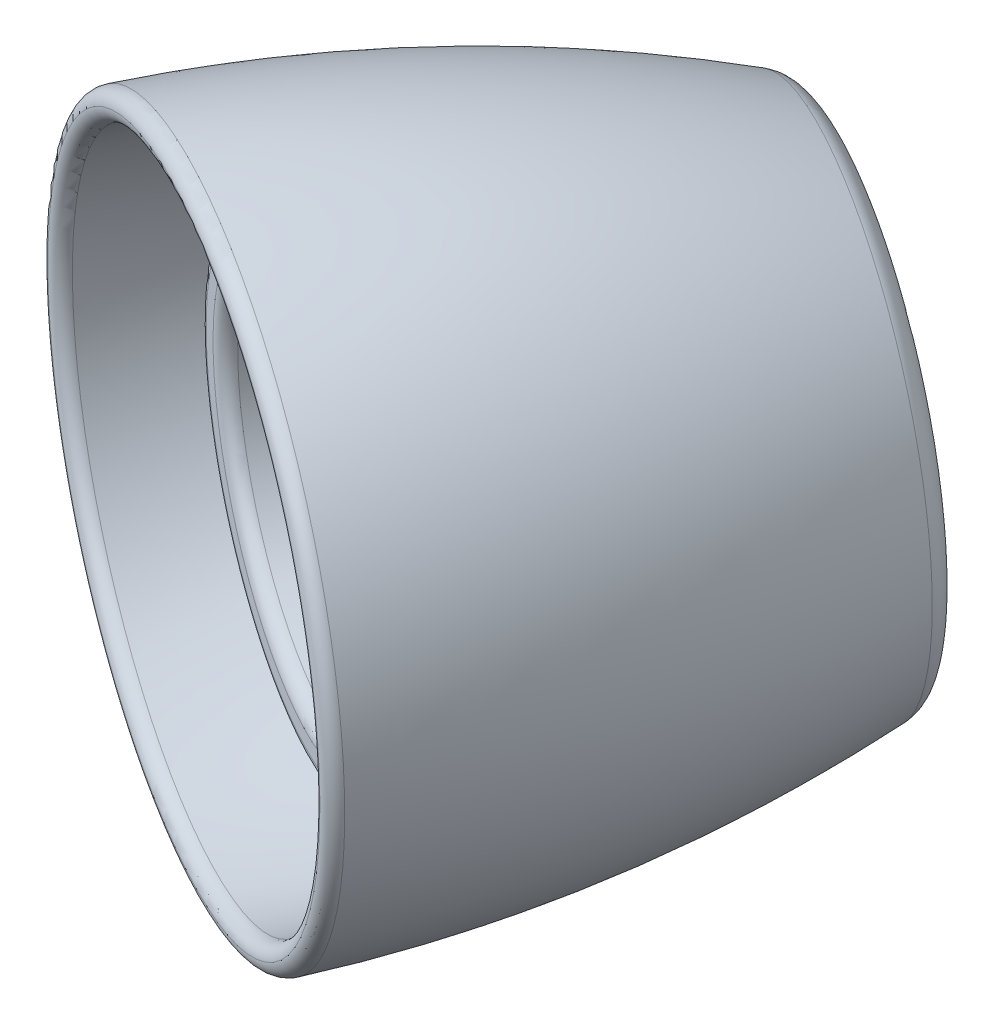
ISO-10303-21;
HEADER;
FILE_DESCRIPTION(('STEP AP214'),'2;1');
FILE_NAME('part.step','',(''),(''),'','','');
FILE_SCHEMA(('AUTOMOTIVE_DESIGN { 1 0 10303 214 1 1 1 1 }'));
ENDSEC;
DATA;
#1=APPLICATION_CONTEXT('core data for automotive mechanical design processes');
#2=APPLICATION_PROTOCOL_DEFINITION('international standard','automotive_design',2000,#1);
#3=PRODUCT_CONTEXT('',#1,'mechanical');
#4=PRODUCT('Part','Part','',(#3));
#5=PRODUCT_RELATED_PRODUCT_CATEGORY('part','',(#4));
#6=PRODUCT_DEFINITION_FORMATION('','',#4);
#7=PRODUCT_DEFINITION_CONTEXT('part definition',#1,'design');
#8=PRODUCT_DEFINITION('design','',#6,#7);
#9=PRODUCT_DEFINITION_SHAPE('','',#8);
#10=(LENGTH_UNIT() NAMED_UNIT(*) SI_UNIT(.MILLI.,.METRE.));
#11=(NAMED_UNIT(*) PLANE_ANGLE_UNIT() SI_UNIT($,.RADIAN.));
#12=(NAMED_UNIT(*) SI_UNIT($,.STERADIAN.) SOLID_ANGLE_UNIT());
#13=UNCERTAINTY_MEASURE_WITH_UNIT(LENGTH_MEASURE(1.E-05),#10,'distance_accuracy_value','');
#14=(GEOMETRIC_REPRESENTATION_CONTEXT(3) GLOBAL_UNCERTAINTY_ASSIGNED_CONTEXT((#13)) GLOBAL_UNIT_ASSIGNED_CONTEXT((#10,
#11,#12)) REPRESENTATION_CONTEXT('',''));
#15=CARTESIAN_POINT('',(0.,0.,0.));
#16=DIRECTION('',(0.,0.,1.));
#17=DIRECTION('',(1.,0.,0.));
#18=AXIS2_PLACEMENT_3D('',#15,#16,#17);
#19=CARTESIAN_POINT('',(-1.92824216806044,-8.23663197239245,23.7918539048536));
#20=DIRECTION('',(-0.453212083113773,-0.0300186712748522,0.890897124866035));
#21=DIRECTION('',(0.41626094218873,-0.890897124866035,0.181739211271491));
#22=AXIS2_PLACEMENT_3D('',#19,#20,#21);
#23=CYLINDRICAL_SURFACE('',#22,3.24582561371548);
#24=CARTESIAN_POINT('',(2.34781383611801,-7.95340580891422,15.3862395317425));
#25=DIRECTION('',(0.453212083113773,0.0300186712748522,-0.890897124866035));
#26=DIRECTION('',(0.41626094218873,-0.890897124866035,0.181739211271491));
#27=AXIS2_PLACEMENT_3D('',#24,#25,#26);
#28=CIRCLE('',#27,3.24582561371548);
#29=CARTESIAN_POINT('',(3.69892426426353,-10.8451025159899,15.976133318704));
#30=VERTEX_POINT('',#29);
#31=EDGE_CURVE('E89',#30,#30,#28,.F.);
#32=ORIENTED_EDGE('',*,*,#31,.F.);
#33=EDGE_LOOP('',(#32));
#34=FACE_BOUND('',#33,.T.);
#35=CARTESIAN_POINT('',(1.84928054469286,-7.98642634731656,16.3662263690952));
#36=DIRECTION('',(-0.453212083113773,-0.0300186712748522,0.890897124866035));
#37=DIRECTION('',(-0.41626094218873,0.890897124866035,-0.181739211271491));
#38=AXIS2_PLACEMENT_3D('',#35,#36,#37);
#39=CIRCLE('',#38,3.24582561371548);
#40=CARTESIAN_POINT('',(0.498170116547343,-5.0947296402409,15.7763325821337));
#41=VERTEX_POINT('',#40);
#42=EDGE_CURVE('E92',#41,#41,#39,.F.);
#43=ORIENTED_EDGE('',*,*,#42,.F.);
#44=EDGE_LOOP('',(#43));
#45=FACE_BOUND('',#44,.T.);
#46=ADVANCED_FACE('F30',(#34,#45),#23,.F.);
#47=CARTESIAN_POINT('',(0.609668121717728,-5.58336181099489,16.0972048205766));
#48=DIRECTION('',(0.453212083113773,0.0300186712748522,-0.890897124866035));
#49=DIRECTION('',(-0.41626094218873,0.890897124866035,-0.181739211271491));
#50=AXIS2_PLACEMENT_3D('',#47,#48,#49);
#51=PLANE('',#50);
#52=CARTESIAN_POINT('',(1.73597752391442,-7.99393101513527,16.5889506503117));
#53=DIRECTION('',(-0.453212083113773,-0.0300186712748522,0.890897124866035));
#54=DIRECTION('',(-0.41626094218873,0.890897124866035,-0.181739211271491));
#55=AXIS2_PLACEMENT_3D('',#52,#53,#54);
#56=CIRCLE('',#55,2.99582561371548);
#57=CARTESIAN_POINT('',(0.488932331316082,-5.32495858927612,16.0444916661681));
#58=VERTEX_POINT('',#57);
#59=EDGE_CURVE('E83',#58,#58,#56,.T.);
#60=ORIENTED_EDGE('',*,*,#59,.F.);
#61=EDGE_LOOP('',(#60));
#62=FACE_BOUND('',#61,.T.);
#63=CARTESIAN_POINT('',(1.73597752391442,-7.99393101513527,16.5889506503117));
#64=DIRECTION('',(-0.453212083113773,-0.0300186712748522,0.890897124866035));
#65=DIRECTION('',(-0.41626094218873,0.890897124866035,-0.181739211271491));
#66=AXIS2_PLACEMENT_3D('',#63,#64,#65);
#67=CIRCLE('',#66,2.95577728545579);
#68=CARTESIAN_POINT('',(0.505602886170546,-5.36063752977838,16.0517700177587));
#69=VERTEX_POINT('',#68);
#70=EDGE_CURVE('E86',#69,#69,#67,.F.);
#71=ORIENTED_EDGE('',*,*,#70,.F.);
#72=EDGE_LOOP('',(#71));
#73=FACE_BOUND('',#72,.T.);
#74=ADVANCED_FACE('F168',(#62,#73),#51,.T.);
#75=CARTESIAN_POINT('',(-1.92824216806044,-8.23663197239245,23.7918539048536));
#76=DIRECTION('',(-0.453212083113773,-0.0300186712748522,0.890897124866035));
#77=DIRECTION('',(0.41626094218873,-0.890897124866035,0.181739211271491));
#78=AXIS2_PLACEMENT_3D('',#75,#76,#77);
#79=CYLINDRICAL_SURFACE('',#78,2.70577728545579);
#80=CARTESIAN_POINT('',(1.62267450313598,-8.00143568295398,16.8116749315282));
#81=DIRECTION('',(-0.453212083113773,-0.0300186712748522,0.890897124866035));
#82=DIRECTION('',(-0.41626094218873,0.890897124866035,-0.181739211271491));
#83=AXIS2_PLACEMENT_3D('',#80,#81,#82);
#84=CIRCLE('',#83,2.70577728545579);
#85=CARTESIAN_POINT('',(0.496365100939285,-5.5908664788136,16.3199291017931));
#86=VERTEX_POINT('',#85);
#87=EDGE_CURVE('E77',#86,#86,#84,.T.);
#88=ORIENTED_EDGE('',*,*,#87,.F.);
#89=EDGE_LOOP('',(#88));
#90=FACE_BOUND('',#89,.T.);
#91=CARTESIAN_POINT('',(1.21478362833358,-8.02845248710135,17.6134823439076));
#92=DIRECTION('',(0.453212083113773,0.0300186712748522,-0.890897124866035));
#93=DIRECTION('',(0.41626094218873,-0.890897124866035,0.181739211271491));
#94=AXIS2_PLACEMENT_3D('',#91,#92,#93);
#95=CIRCLE('',#94,2.70577728545579);
#96=CARTESIAN_POINT('',(2.34109303053027,-10.4390216912417,18.1052281736427));
#97=VERTEX_POINT('',#96);
#98=EDGE_CURVE('E80',#97,#97,#95,.T.);
#99=ORIENTED_EDGE('',*,*,#98,.F.);
#100=EDGE_LOOP('',(#99));
#101=FACE_BOUND('',#100,.T.);
#102=ADVANCED_FACE('F164',(#90,#101),#79,.F.);
#103=CARTESIAN_POINT('',(-0.0248287946415541,-5.62538795077968,17.3444607953891));
#104=DIRECTION('',(-0.453212083113773,-0.0300186712748522,0.890897124866035));
#105=DIRECTION('',(0.41626094218873,-0.890897124866035,0.181739211271491));
#106=AXIS2_PLACEMENT_3D('',#103,#104,#105);
#107=PLANE('',#106);
#108=CARTESIAN_POINT('',(1.10148060755513,-8.03595715492006,17.8362066251241));
#109=DIRECTION('',(0.453212083113773,0.0300186712748522,-0.890897124866035));
#110=DIRECTION('',(0.41626094218873,-0.890897124866035,0.181739211271491));
#111=AXIS2_PLACEMENT_3D('',#108,#109,#110);
#112=CIRCLE('',#111,2.95577728545579);
#113=CARTESIAN_POINT('',(2.33185524529901,-10.669250640277,18.373387257677));
#114=VERTEX_POINT('',#113);
#115=EDGE_CURVE('E71',#114,#114,#112,.F.);
#116=ORIENTED_EDGE('',*,*,#115,.F.);
#117=EDGE_LOOP('',(#116));
#118=FACE_BOUND('',#117,.T.);
#119=CARTESIAN_POINT('',(1.10148060755513,-8.03595715492006,17.8362066251241));
#120=DIRECTION('',(0.453212083113773,0.0300186712748522,-0.890897124866035));
#121=DIRECTION('',(0.41626094218873,-0.890897124866035,0.181739211271491));
#122=AXIS2_PLACEMENT_3D('',#119,#120,#121);
#123=CIRCLE('',#122,2.99582561371548);
#124=CARTESIAN_POINT('',(2.34852580015347,-10.7049295807792,18.3806656092677));
#125=VERTEX_POINT('',#124);
#126=EDGE_CURVE('E74',#125,#125,#123,.T.);
#127=ORIENTED_EDGE('',*,*,#126,.F.);
#128=EDGE_LOOP('',(#127));
#129=FACE_BOUND('',#128,.T.);
#130=ADVANCED_FACE('F160',(#118,#129),#107,.T.);
#131=CARTESIAN_POINT('',(-1.92824216806044,-8.23663197239245,23.7918539048536));
#132=DIRECTION('',(-0.453212083113773,-0.0300186712748522,0.890897124866035));
#133=DIRECTION('',(0.41626094218873,-0.890897124866035,0.181739211271491));
#134=AXIS2_PLACEMENT_3D('',#131,#132,#133);
#135=CYLINDRICAL_SURFACE('',#134,3.24582561371548);
#136=CARTESIAN_POINT('',(0.988177586776692,-8.04346182273878,18.0589309063406));
#137=DIRECTION('',(0.453212083113773,0.0300186712748522,-0.890897124866035));
#138=DIRECTION('',(0.41626094218873,-0.890897124866035,0.181739211271491));
#139=AXIS2_PLACEMENT_3D('',#136,#137,#138);
#140=CIRCLE('',#139,3.24582561371548);
#141=CARTESIAN_POINT('',(2.33928801492221,-10.9351585298144,18.6488246933021));
#142=VERTEX_POINT('',#141);
#143=EDGE_CURVE('E65',#142,#142,#140,.F.);
#144=ORIENTED_EDGE('',*,*,#143,.F.);
#145=EDGE_LOOP('',(#144));
#146=FACE_BOUND('',#145,.T.);
#147=CARTESIAN_POINT('',(0.528727867670788,-8.07389364615885,18.9620896018452));
#148=DIRECTION('',(0.453212083113773,0.0300186712748522,-0.890897124866035));
#149=DIRECTION('',(0.41626094218873,-0.890897124866035,0.181739211271491));
#150=AXIS2_PLACEMENT_3D('',#147,#148,#149);
#151=CIRCLE('',#150,3.24582561371548);
#152=CARTESIAN_POINT('',(1.87983829581631,-10.9655903532345,19.5519833888067));
#153=VERTEX_POINT('',#152);
#154=EDGE_CURVE('E68',#153,#153,#151,.T.);
#155=ORIENTED_EDGE('',*,*,#154,.F.);
#156=EDGE_LOOP('',(#155));
#157=FACE_BOUND('',#156,.T.);
#158=ADVANCED_FACE('F156',(#146,#157),#135,.F.);
#159=CARTESIAN_POINT('',(-0.935685581253175,-5.18970160690191,18.5949200961003));
#160=DIRECTION('',(-0.453212083113773,-0.0300186712748522,0.890897124866035));
#161=DIRECTION('',(0.41626094218873,-0.890897124866035,0.181739211271491));
#162=AXIS2_PLACEMENT_3D('',#159,#160,#161);
#163=PLANE('',#162);
#164=CARTESIAN_POINT('',(0.415424846892345,-8.08139831397756,19.1848138830617));
#165=DIRECTION('',(0.453212083113773,0.0300186712748522,-0.890897124866035));
#166=DIRECTION('',(0.41626094218873,-0.890897124866035,0.181739211271491));
#167=AXIS2_PLACEMENT_3D('',#164,#165,#166);
#168=CIRCLE('',#167,3.49582561371548);
#169=CARTESIAN_POINT('',(1.87060051058505,-11.1958193022697,19.8201424728411));
#170=VERTEX_POINT('',#169);
#171=EDGE_CURVE('E45',#170,#170,#168,.F.);
#172=ORIENTED_EDGE('',*,*,#171,.F.);
#173=EDGE_LOOP('',(#172));
#174=FACE_BOUND('',#173,.T.);
#175=CARTESIAN_POINT('',(0.415424846892345,-8.08139831397756,19.1848138830617));
#176=DIRECTION('',(0.453212083113773,0.0300186712748522,-0.890897124866035));
#177=DIRECTION('',(0.41626094218873,-0.890897124866035,0.181739211271491));
#178=AXIS2_PLACEMENT_3D('',#175,#176,#177);
#179=CIRCLE('',#178,3.7785708845634);
#180=CARTESIAN_POINT('',(1.98829632342761,-11.4477162511376,19.8715283753557));
#181=VERTEX_POINT('',#180);
#182=EDGE_CURVE('E50',#181,#181,#179,.T.);
#183=ORIENTED_EDGE('',*,*,#182,.F.);
#184=EDGE_LOOP('',(#183));
#185=FACE_BOUND('',#184,.T.);
#186=ADVANCED_FACE('F152',(#174,#185),#163,.T.);
#187=CARTESIAN_POINT('',(-1.92824216806044,-8.23663197239245,23.7918539048536));
#188=DIRECTION('',(-0.453212083113773,-0.0300186712748522,0.890897124866035));
#189=DIRECTION('',(0.41626094218873,-0.890897124866035,0.181739211271491));
#190=AXIS2_PLACEMENT_3D('',#187,#188,#189);
#191=CYLINDRICAL_SURFACE('',#190,4.0285708845634);
#192=CARTESIAN_POINT('',(1.47541420474449,-8.01118952371409,17.1011503919848));
#193=DIRECTION('',(0.453212083113773,0.0300186712748522,-0.890897124866035));
#194=DIRECTION('',(0.41626094218873,-0.890897124866035,0.181739211271491));
#195=AXIS2_PLACEMENT_3D('',#192,#193,#194);
#196=CIRCLE('',#195,4.0285708845634);
#197=CARTESIAN_POINT('',(3.15235091682694,-11.6002317420906,17.8332996870967));
#198=VERTEX_POINT('',#197);
#199=EDGE_CURVE('E59',#198,#198,#196,.T.);
#200=ORIENTED_EDGE('',*,*,#199,.F.);
#201=EDGE_LOOP('',(#200));
#202=FACE_BOUND('',#201,.T.);
#203=CARTESIAN_POINT('',(0.528727867670788,-8.07389364615885,18.9620896018452));
#204=DIRECTION('',(0.453212083113773,0.0300186712748522,-0.890897124866035));
#205=DIRECTION('',(0.41626094218873,-0.890897124866035,0.181739211271491));
#206=AXIS2_PLACEMENT_3D('',#203,#204,#205);
#207=CIRCLE('',#206,4.0285708845634);
#208=CARTESIAN_POINT('',(2.20566457975324,-11.6629358645354,19.6942388969571));
#209=VERTEX_POINT('',#208);
#210=EDGE_CURVE('E62',#209,#209,#207,.F.);
#211=ORIENTED_EDGE('',*,*,#210,.F.);
#212=EDGE_LOOP('',(#211));
#213=FACE_BOUND('',#212,.T.);
#214=ADVANCED_FACE('F148',(#202,#213),#191,.T.);
#215=CARTESIAN_POINT('',(-0.0882194865595111,-4.41464263751882,16.1462768156565));
#216=DIRECTION('',(-0.453212083113773,-0.0300186712748522,0.890897124866035));
#217=DIRECTION('',(0.41626094218873,-0.890897124866035,0.181739211271491));
#218=AXIS2_PLACEMENT_3D('',#215,#216,#217);
#219=PLANE('',#218);
#220=CARTESIAN_POINT('',(1.58871722552294,-8.00368485589538,16.8784261107683));
#221=DIRECTION('',(0.453212083113773,0.0300186712748522,-0.890897124866035));
#222=DIRECTION('',(0.41626094218873,-0.890897124866035,0.181739211271491));
#223=AXIS2_PLACEMENT_3D('',#220,#221,#222);
#224=CIRCLE('',#223,4.2785708845634);
#225=CARTESIAN_POINT('',(3.36971917315257,-11.8154513554884,17.656010208698));
#226=VERTEX_POINT('',#225);
#227=EDGE_CURVE('E53',#226,#226,#224,.F.);
#228=ORIENTED_EDGE('',*,*,#227,.F.);
#229=EDGE_LOOP('',(#228));
#230=FACE_BOUND('',#229,.T.);
#231=CARTESIAN_POINT('',(1.58871722552294,-8.00368485589538,16.8784261107683));
#232=DIRECTION('',(0.453212083113773,0.0300186712748522,-0.890897124866035));
#233=DIRECTION('',(0.41626094218873,-0.890897124866035,0.181739211271491));
#234=AXIS2_PLACEMENT_3D('',#231,#232,#233);
#235=CIRCLE('',#234,4.79273774166151);
#236=CARTESIAN_POINT('',(3.58374675353045,-12.2735211301785,17.749454487769));
#237=VERTEX_POINT('',#236);
#238=EDGE_CURVE('E56',#237,#237,#235,.T.);
#239=ORIENTED_EDGE('',*,*,#238,.F.);
#240=EDGE_LOOP('',(#239));
#241=FACE_BOUND('',#240,.T.);
#242=ADVANCED_FACE('F144',(#230,#241),#219,.T.);
#243=CARTESIAN_POINT('',(2.17155907076244,-4.55561842241409,12.0205937841695));
#244=CARTESIAN_POINT('',(1.73924212667713,-4.33531117061553,12.5993762028067));
#245=CARTESIAN_POINT('',(0.886072689311537,-3.95010381774628,13.7955572675327));
#246=CARTESIAN_POINT('',(-0.315878130017248,-3.5609253915247,15.6478758867091));
#247=CARTESIAN_POINT('',(-1.45022401878436,-3.35375627529409,17.5703422472452));
#248=CARTESIAN_POINT('',(-2.16576616894373,-3.33850083961202,18.9087010873886));
#249=CARTESIAN_POINT('',(-2.50783947202256,-3.36115630113467,19.5811262065507));
#250=B_SPLINE_CURVE_WITH_KNOTS('',3,(#243,#244,#245,#246,#247,#248,#249),.UNSPECIFIED.,.F.,.F.,
(4,1,1,1,4),(0.,0.25,0.5,0.75,1.),.UNSPECIFIED.);
#251=CARTESIAN_POINT('',(-1.92824216806044,-8.23663197239245,23.7918539048536));
#252=DIRECTION('',(-0.453212083113773,-0.0300186712748522,0.890897124866035));
#253=AXIS1_PLACEMENT('',#251,#252);
#254=SURFACE_OF_REVOLUTION('',#250,#253);
#255=CARTESIAN_POINT('',(1.49343277529732,-8.00999605697651,17.0657305669232));
#256=DIRECTION('',(0.453212083113773,0.0300186712748522,-0.890897124866035));
#257=DIRECTION('',(0.41626094218873,-0.890897124866035,0.181739211271491));
#258=AXIS2_PLACEMENT_3D('',#255,#256,#257);
#259=CIRCLE('',#258,5.03955618251426);
#260=CARTESIAN_POINT('',(3.59120318004374,-12.4997221705793,17.9816155326917));
#261=VERTEX_POINT('',#260);
#262=EDGE_CURVE('E41',#261,#261,#259,.F.);
#263=ORIENTED_EDGE('',*,*,#262,.F.);
#264=EDGE_LOOP('',(#263));
#265=FACE_BOUND('',#264,.T.);
#266=CARTESIAN_POINT('',(-0.168631587893766,-8.120083509662,20.3329169851139));
#267=DIRECTION('',(0.453212083113773,0.0300186712748522,-0.890897124866035));
#268=DIRECTION('',(0.41626094218873,-0.890897124866035,0.181739211271491));
#269=AXIS2_PLACEMENT_3D('',#266,#267,#268);
#270=CIRCLE('',#269,5.34884288988972);
#271=CARTESIAN_POINT('',(2.05788279307122,-12.8853522616249,21.3050114731376));
#272=VERTEX_POINT('',#271);
#273=EDGE_CURVE('E95',#272,#272,#270,.T.);
#274=ORIENTED_EDGE('',*,*,#273,.F.);
#275=EDGE_LOOP('',(#274));
#276=FACE_BOUND('',#275,.T.);
#277=ADVANCED_FACE('F140',(#265,#276),#254,.F.);
#278=CARTESIAN_POINT('',(-2.50783947202256,-3.36115630113467,19.5811262065507));
#279=DIRECTION('',(-0.453212083113773,-0.0300186712748522,0.890897124866035));
#280=DIRECTION('',(0.41626094218873,-0.890897124866035,0.181739211271491));
#281=AXIS2_PLACEMENT_3D('',#278,#279,#280);
#282=PLANE('',#281);
#283=CARTESIAN_POINT('',(-0.28081624594187,-8.12751410230836,20.5534428559655));
#284=DIRECTION('',(0.453212083113773,0.0300186712748522,-0.890897124866035));
#285=DIRECTION('',(0.41626094218873,-0.890897124866035,0.181739211271491));
#286=AXIS2_PLACEMENT_3D('',#283,#284,#285);
#287=CIRCLE('',#286,5.59884535934687);
#288=CARTESIAN_POINT('',(2.04976439850886,-13.11550933552,21.5709725956043));
#289=VERTEX_POINT('',#288);
#290=EDGE_CURVE('E101',#289,#289,#287,.T.);
#291=ORIENTED_EDGE('',*,*,#290,.F.);
#292=EDGE_LOOP('',(#291));
#293=FACE_BOUND('',#292,.T.);
#294=CARTESIAN_POINT('',(-0.28081624594187,-8.12751410230836,20.5534428559655));
#295=DIRECTION('',(0.453212083113773,0.0300186712748522,-0.890897124866035));
#296=DIRECTION('',(0.41626094218873,-0.890897124866035,0.181739211271491));
#297=AXIS2_PLACEMENT_3D('',#294,#295,#296);
#298=CIRCLE('',#297,5.59883071113216);
#299=CARTESIAN_POINT('',(2.0497583010292,-13.1154962854677,21.5709699334493));
#300=VERTEX_POINT('',#299);
#301=EDGE_CURVE('E104',#300,#300,#298,.F.);
#302=ORIENTED_EDGE('',*,*,#301,.F.);
#303=EDGE_LOOP('',(#302));
#304=FACE_BOUND('',#303,.T.);
#305=ADVANCED_FACE('F135',(#293,#304),#282,.T.);
#306=CARTESIAN_POINT('',(-2.71596994311693,-2.91570773870165,19.490256600915));
#307=CARTESIAN_POINT('',(-0.607069006577418,-2.7760238990073,15.3447056524892));
#308=CARTESIAN_POINT('',(2.05860671361165,-4.13443398663146,11.7759105578051));
#309=B_SPLINE_CURVE_WITH_KNOTS('',2,(#306,#307,#308),.UNSPECIFIED.,.F.,.F.,(3,3),(0.,1.),.UNSPECIFIED.);
#310=CARTESIAN_POINT('',(-1.92824216806044,-8.23663197239245,23.7918539048536));
#311=DIRECTION('',(-0.453212083113773,-0.0300186712748522,0.890897124866035));
#312=AXIS1_PLACEMENT('',#310,#311);
#313=SURFACE_OF_REVOLUTION('',#309,#312);
#314=CARTESIAN_POINT('',(-0.166406486762288,-8.11993612925907,20.3285430147931));
#315=DIRECTION('',(0.453212083113773,0.0300186712748522,-0.890897124866035));
#316=DIRECTION('',(0.41626094218873,-0.890897124866035,0.181739211271491));
#317=AXIS2_PLACEMENT_3D('',#314,#315,#316);
#318=CIRCLE('',#317,5.84883343245303);
#319=CARTESIAN_POINT('',(2.26823442853555,-13.3306450180518,21.3915053896654));
#320=VERTEX_POINT('',#319);
#321=EDGE_CURVE('E98',#320,#320,#318,.F.);
#322=ORIENTED_EDGE('',*,*,#321,.F.);
#323=EDGE_LOOP('',(#322));
#324=FACE_BOUND('',#323,.T.);
#325=CARTESIAN_POINT('',(3.64994534361208,-7.86715864310271,12.8265875289676));
#326=DIRECTION('',(0.453212083113773,0.0300186712748522,-0.890897124866035));
#327=DIRECTION('',(0.41626094218873,-0.890897124866035,0.181739211271491));
#328=AXIS2_PLACEMENT_3D('',#325,#326,#327);
#329=CIRCLE('',#328,4.30199098337212);
#330=CARTESIAN_POINT('',(5.44069616363798,-11.6997900413885,13.6084279771828));
#331=VERTEX_POINT('',#330);
#332=EDGE_CURVE('E116',#331,#331,#329,.T.);
#333=ORIENTED_EDGE('',*,*,#332,.F.);
#334=EDGE_LOOP('',(#333));
#335=FACE_BOUND('',#334,.T.);
#336=ADVANCED_FACE('F130',(#324,#335),#313,.F.);
#337=CARTESIAN_POINT('',(2.65337491106308,-5.40737896745309,12.0355859011746));
#338=DIRECTION('',(0.453212083113773,0.0300186712748522,-0.890897124866035));
#339=DIRECTION('',(-0.41626094218873,0.890897124866035,-0.181739211271491));
#340=AXIS2_PLACEMENT_3D('',#337,#338,#339);
#341=PLANE('',#340);
#342=CARTESIAN_POINT('',(3.79809250208208,-7.85734606083469,12.5353687321712));
#343=DIRECTION('',(-0.453212083113773,-0.0300186712748522,0.890897124866035));
#344=DIRECTION('',(-0.41626094218873,0.890897124866035,-0.181739211271491));
#345=AXIS2_PLACEMENT_3D('',#342,#343,#344);
#346=CIRCLE('',#345,3.83291702671831);
#347=CARTESIAN_POINT('',(2.20259884920909,-4.44261130188127,11.8387774148664));
#348=VERTEX_POINT('',#347);
#349=EDGE_CURVE('E110',#348,#348,#346,.T.);
#350=ORIENTED_EDGE('',*,*,#349,.F.);
#351=EDGE_LOOP('',(#350));
#352=FACE_BOUND('',#351,.T.);
#353=CARTESIAN_POINT('',(3.79809250208208,-7.85734606083469,12.5353687321712));
#354=DIRECTION('',(-0.453212083113773,-0.0300186712748522,0.890897124866035));
#355=DIRECTION('',(-0.41626094218873,0.890897124866035,-0.181739211271491));
#356=AXIS2_PLACEMENT_3D('',#353,#354,#355);
#357=CIRCLE('',#356,3.25);
#358=CARTESIAN_POINT('',(2.44524443996871,-4.96193040502008,11.9447162955389));
#359=VERTEX_POINT('',#358);
#360=EDGE_CURVE('E113',#359,#359,#357,.F.);
#361=ORIENTED_EDGE('',*,*,#360,.F.);
#362=EDGE_LOOP('',(#361));
#363=FACE_BOUND('',#362,.T.);
#364=ADVANCED_FACE('F134',(#352,#363),#341,.T.);
#365=CARTESIAN_POINT('',(-1.92824216806044,-8.23663197239245,23.7918539048536));
#366=DIRECTION('',(-0.453212083113773,-0.0300186712748522,0.890897124866035));
#367=DIRECTION('',(0.41626094218873,-0.890897124866035,0.181739211271491));
#368=AXIS2_PLACEMENT_3D('',#365,#366,#367);
#369=CYLINDRICAL_SURFACE('',#368,2.75);
#370=CARTESIAN_POINT('',(2.57441198008973,-7.93839699637629,14.9408064939086));
#371=DIRECTION('',(-0.453212083113773,-0.0300186712748522,0.890897124866035));
#372=DIRECTION('',(-0.41626094218873,0.890897124866035,-0.181739211271491));
#373=AXIS2_PLACEMENT_3D('',#370,#371,#372);
#374=CIRCLE('',#373,2.75);
#375=CARTESIAN_POINT('',(1.42969438907073,-5.48842990299469,14.441023662912));
#376=VERTEX_POINT('',#375);
#377=EDGE_CURVE('E37',#376,#376,#374,.F.);
#378=ORIENTED_EDGE('',*,*,#377,.F.);
#379=EDGE_LOOP('',(#378));
#380=FACE_BOUND('',#379,.T.);
#381=CARTESIAN_POINT('',(3.5714864605252,-7.87235539647212,12.9808172946042));
#382=DIRECTION('',(-0.453212083113773,-0.0300186712748522,0.890897124866035));
#383=DIRECTION('',(-0.41626094218873,0.890897124866035,-0.181739211271491));
#384=AXIS2_PLACEMENT_3D('',#381,#382,#383);
#385=CIRCLE('',#384,2.75);
#386=CARTESIAN_POINT('',(2.42676886950619,-5.42238830309052,12.4810344636076));
#387=VERTEX_POINT('',#386);
#388=EDGE_CURVE('E107',#387,#387,#385,.T.);
#389=ORIENTED_EDGE('',*,*,#388,.F.);
#390=EDGE_LOOP('',(#389));
#391=FACE_BOUND('',#390,.T.);
#392=ADVANCED_FACE('F180',(#380,#391),#369,.F.);
#393=CARTESIAN_POINT('',(3.5714864605252,-7.87235539647212,12.9808172946042));
#394=DIRECTION('',(-0.453212083113773,-0.0300186712748522,0.890897124866035));
#395=DIRECTION('',(0.41626094218873,-0.890897124866035,0.181739211271491));
#396=AXIS2_PLACEMENT_3D('',#393,#394,#395);
#397=TOROIDAL_SURFACE('',#396,3.83291702671831,0.5);
#398=ORIENTED_EDGE('',*,*,#349,.T.);
#399=EDGE_LOOP('',(#398));
#400=FACE_BOUND('',#399,.T.);
#401=ORIENTED_EDGE('',*,*,#332,.T.);
#402=EDGE_LOOP('',(#401));
#403=FACE_BOUND('',#402,.T.);
#404=ADVANCED_FACE('F176',(#400,#403),#397,.T.);
#405=CARTESIAN_POINT('',(3.5714864605252,-7.87235539647212,12.9808172946042));
#406=DIRECTION('',(0.453212083113773,0.0300186712748522,-0.890897124866035));
#407=DIRECTION('',(-0.41626094218873,0.890897124866035,-0.181739211271491));
#408=AXIS2_PLACEMENT_3D('',#405,#406,#407);
#409=TOROIDAL_SURFACE('',#408,3.25,0.5);
#410=ORIENTED_EDGE('',*,*,#388,.T.);
#411=EDGE_LOOP('',(#410));
#412=FACE_BOUND('',#411,.T.);
#413=ORIENTED_EDGE('',*,*,#360,.T.);
#414=EDGE_LOOP('',(#413));
#415=FACE_BOUND('',#414,.T.);
#416=ADVANCED_FACE('F179',(#412,#415),#409,.T.);
#417=CARTESIAN_POINT('',(-0.167513225163445,-8.12000943448965,20.330718574749));
#418=DIRECTION('',(-0.453212083113773,-0.0300186712748522,0.890897124866035));
#419=DIRECTION('',(0.41626094218873,-0.890897124866035,0.181739211271491));
#420=AXIS2_PLACEMENT_3D('',#417,#418,#419);
#421=TOROIDAL_SURFACE('',#420,5.59884535934687,0.25);
#422=ORIENTED_EDGE('',*,*,#321,.T.);
#423=EDGE_LOOP('',(#422));
#424=FACE_BOUND('',#423,.T.);
#425=ORIENTED_EDGE('',*,*,#290,.T.);
#426=EDGE_LOOP('',(#425));
#427=FACE_BOUND('',#426,.T.);
#428=ADVANCED_FACE('F184',(#424,#427),#421,.T.);
#429=CARTESIAN_POINT('',(-0.167513225163426,-8.12000943448965,20.330718574749));
#430=DIRECTION('',(-0.453212083113773,-0.0300186712748522,0.890897124866035));
#431=DIRECTION('',(0.41626094218873,-0.890897124866035,0.181739211271491));
#432=AXIS2_PLACEMENT_3D('',#429,#430,#431);
#433=TOROIDAL_SURFACE('',#432,5.59883071113216,0.25);
#434=ORIENTED_EDGE('',*,*,#301,.T.);
#435=EDGE_LOOP('',(#434));
#436=FACE_BOUND('',#435,.T.);
#437=ORIENTED_EDGE('',*,*,#273,.T.);
#438=EDGE_LOOP('',(#437));
#439=FACE_BOUND('',#438,.T.);
#440=ADVANCED_FACE('F188',(#436,#439),#433,.T.);
#441=CARTESIAN_POINT('',(2.34781383611801,-7.95340580891422,15.3862395317425));
#442=DIRECTION('',(-0.453212083113773,-0.0300186712748522,0.890897124866035));
#443=DIRECTION('',(0.41626094218873,-0.890897124866035,0.181739211271491));
#444=AXIS2_PLACEMENT_3D('',#441,#442,#443);
#445=TOROIDAL_SURFACE('',#444,2.99582561371548,0.25);
#446=CARTESIAN_POINT('',(2.46111290813377,-7.94590140264327,15.1635230127668));
#447=DIRECTION('',(0.453212083113773,0.0300186712748522,-0.890897124866035));
#448=DIRECTION('',(0.41626094218873,-0.890897124866035,0.181739211271491));
#449=AXIS2_PLACEMENT_3D('',#446,#447,#448);
#450=CIRCLE('',#449,2.99791280685829);
#451=CARTESIAN_POINT('',(3.70902691771627,-10.6167333028724,15.7083613217459));
#452=VERTEX_POINT('',#451);
#453=EDGE_CURVE('E10',#452,#452,#450,.F.);
#454=ORIENTED_EDGE('',*,*,#453,.F.);
#455=EDGE_LOOP('',(#454));
#456=FACE_BOUND('',#455,.T.);
#457=ORIENTED_EDGE('',*,*,#31,.T.);
#458=EDGE_LOOP('',(#457));
#459=FACE_BOUND('',#458,.T.);
#460=ADVANCED_FACE('F192',(#456,#459),#445,.F.);
#461=CARTESIAN_POINT('',(1.84928054469286,-7.98642634731656,16.3662263690952));
#462=DIRECTION('',(0.453212083113773,0.0300186712748522,-0.890897124866035));
#463=DIRECTION('',(-0.41626094218873,0.890897124866035,-0.181739211271491));
#464=AXIS2_PLACEMENT_3D('',#461,#462,#463);
#465=TOROIDAL_SURFACE('',#464,2.99582561371548,0.25);
#466=ORIENTED_EDGE('',*,*,#59,.T.);
#467=EDGE_LOOP('',(#466));
#468=FACE_BOUND('',#467,.T.);
#469=ORIENTED_EDGE('',*,*,#42,.T.);
#470=EDGE_LOOP('',(#469));
#471=FACE_BOUND('',#470,.T.);
#472=ADVANCED_FACE('F196',(#468,#471),#465,.F.);
#473=CARTESIAN_POINT('',(1.62267450313598,-8.00143568295398,16.8116749315282));
#474=DIRECTION('',(0.453212083113773,0.0300186712748522,-0.890897124866035));
#475=DIRECTION('',(-0.41626094218873,0.890897124866035,-0.181739211271491));
#476=AXIS2_PLACEMENT_3D('',#473,#474,#475);
#477=TOROIDAL_SURFACE('',#476,2.95577728545579,0.25);
#478=ORIENTED_EDGE('',*,*,#87,.T.);
#479=EDGE_LOOP('',(#478));
#480=FACE_BOUND('',#479,.T.);
#481=ORIENTED_EDGE('',*,*,#70,.T.);
#482=EDGE_LOOP('',(#481));
#483=FACE_BOUND('',#482,.T.);
#484=ADVANCED_FACE('F200',(#480,#483),#477,.T.);
#485=CARTESIAN_POINT('',(1.21478362833358,-8.02845248710135,17.6134823439076));
#486=DIRECTION('',(-0.453212083113773,-0.0300186712748522,0.890897124866035));
#487=DIRECTION('',(0.41626094218873,-0.890897124866035,0.181739211271491));
#488=AXIS2_PLACEMENT_3D('',#485,#486,#487);
#489=TOROIDAL_SURFACE('',#488,2.95577728545579,0.25);
#490=ORIENTED_EDGE('',*,*,#115,.T.);
#491=EDGE_LOOP('',(#490));
#492=FACE_BOUND('',#491,.T.);
#493=ORIENTED_EDGE('',*,*,#98,.T.);
#494=EDGE_LOOP('',(#493));
#495=FACE_BOUND('',#494,.T.);
#496=ADVANCED_FACE('F204',(#492,#495),#489,.T.);
#497=CARTESIAN_POINT('',(0.988177586776692,-8.04346182273878,18.0589309063406));
#498=DIRECTION('',(-0.453212083113773,-0.0300186712748522,0.890897124866035));
#499=DIRECTION('',(0.41626094218873,-0.890897124866035,0.181739211271491));
#500=AXIS2_PLACEMENT_3D('',#497,#498,#499);
#501=TOROIDAL_SURFACE('',#500,2.99582561371548,0.25);
#502=ORIENTED_EDGE('',*,*,#143,.T.);
#503=EDGE_LOOP('',(#502));
#504=FACE_BOUND('',#503,.T.);
#505=ORIENTED_EDGE('',*,*,#126,.T.);
#506=EDGE_LOOP('',(#505));
#507=FACE_BOUND('',#506,.T.);
#508=ADVANCED_FACE('F208',(#504,#507),#501,.F.);
#509=CARTESIAN_POINT('',(1.47541420474449,-8.01118952371409,17.1011503919848));
#510=DIRECTION('',(-0.453212083113773,-0.0300186712748522,0.890897124866035));
#511=DIRECTION('',(0.41626094218873,-0.890897124866035,0.181739211271491));
#512=AXIS2_PLACEMENT_3D('',#509,#510,#511);
#513=TOROIDAL_SURFACE('',#512,4.2785708845634,0.25);
#514=ORIENTED_EDGE('',*,*,#227,.T.);
#515=EDGE_LOOP('',(#514));
#516=FACE_BOUND('',#515,.T.);
#517=ORIENTED_EDGE('',*,*,#199,.T.);
#518=EDGE_LOOP('',(#517));
#519=FACE_BOUND('',#518,.T.);
#520=ADVANCED_FACE('F212',(#516,#519),#513,.F.);
#521=CARTESIAN_POINT('',(0.528727867670788,-8.07389364615885,18.9620896018452));
#522=DIRECTION('',(-0.453212083113773,-0.0300186712748522,0.890897124866035));
#523=DIRECTION('',(0.41626094218873,-0.890897124866035,0.181739211271491));
#524=AXIS2_PLACEMENT_3D('',#521,#522,#523);
#525=TOROIDAL_SURFACE('',#524,3.49582561371548,0.25);
#526=ORIENTED_EDGE('',*,*,#171,.T.);
#527=EDGE_LOOP('',(#526));
#528=FACE_BOUND('',#527,.T.);
#529=ORIENTED_EDGE('',*,*,#154,.T.);
#530=EDGE_LOOP('',(#529));
#531=FACE_BOUND('',#530,.T.);
#532=ADVANCED_FACE('F216',(#528,#531),#525,.T.);
#533=CARTESIAN_POINT('',(0.528727867670788,-8.07389364615885,18.9620896018452));
#534=DIRECTION('',(-0.453212083113773,-0.0300186712748522,0.890897124866035));
#535=DIRECTION('',(0.41626094218873,-0.890897124866035,0.181739211271491));
#536=AXIS2_PLACEMENT_3D('',#533,#534,#535);
#537=TOROIDAL_SURFACE('',#536,3.7785708845634,0.25);
#538=ORIENTED_EDGE('',*,*,#210,.T.);
#539=EDGE_LOOP('',(#538));
#540=FACE_BOUND('',#539,.T.);
#541=ORIENTED_EDGE('',*,*,#182,.T.);
#542=EDGE_LOOP('',(#541));
#543=FACE_BOUND('',#542,.T.);
#544=ADVANCED_FACE('F220',(#540,#543),#537,.T.);
#545=CARTESIAN_POINT('',(1.47541420474447,-8.01118952371409,17.1011503919849));
#546=DIRECTION('',(-0.453212083113773,-0.0300186712748522,0.890897124866035));
#547=DIRECTION('',(0.41626094218873,-0.890897124866035,0.181739211271491));
#548=AXIS2_PLACEMENT_3D('',#545,#546,#547);
#549=TOROIDAL_SURFACE('',#548,4.79273774166151,0.25);
#550=ORIENTED_EDGE('',*,*,#262,.T.);
#551=EDGE_LOOP('',(#550));
#552=FACE_BOUND('',#551,.T.);
#553=ORIENTED_EDGE('',*,*,#238,.T.);
#554=EDGE_LOOP('',(#553));
#555=FACE_BOUND('',#554,.T.);
#556=ADVANCED_FACE('F223',(#552,#555),#549,.F.);
#557=CARTESIAN_POINT('',(2.57441198008973,-7.93839699637629,14.9408064939086));
#558=DIRECTION('',(0.453212083113773,0.0300186712748522,-0.890897124866035));
#559=DIRECTION('',(-0.41626094218873,0.890897124866035,-0.181739211271491));
#560=AXIS2_PLACEMENT_3D('',#557,#558,#559);
#561=TOROIDAL_SURFACE('',#560,3.,0.25);
#562=ORIENTED_EDGE('',*,*,#453,.T.);
#563=EDGE_LOOP('',(#562));
#564=FACE_BOUND('',#563,.T.);
#565=ORIENTED_EDGE('',*,*,#377,.T.);
#566=EDGE_LOOP('',(#565));
#567=FACE_BOUND('',#566,.T.);
#568=ADVANCED_FACE('F32',(#564,#567),#561,.T.);
#569=CLOSED_SHELL('',(#46,#74,#102,#130,#158,#186,#214,#242,#277,#305,#336,#364,#392,#404,#416,
#428,#440,#460,#472,#484,#496,#508,#520,#532,#544,#556,#568));
#570=MANIFOLD_SOLID_BREP('B2',#569);
#571=ADVANCED_BREP_SHAPE_REPRESENTATION('',(#18,#570),#14);
#572=SHAPE_DEFINITION_REPRESENTATION(#9,#571);
ENDSEC;
END-ISO-10303-21;
